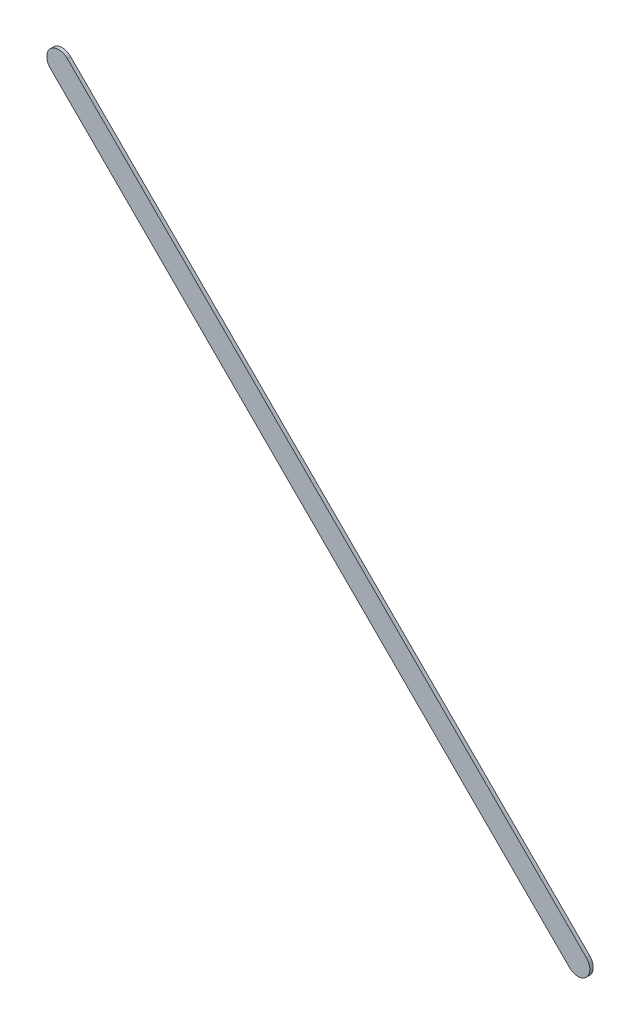
ISO-10303-21;
HEADER;
FILE_DESCRIPTION(('STEP AP214'),'2;1');
FILE_NAME('part.step','',(''),(''),'','','');
FILE_SCHEMA(('AUTOMOTIVE_DESIGN { 1 0 10303 214 1 1 1 1 }'));
ENDSEC;
DATA;
#1=APPLICATION_CONTEXT('core data for automotive mechanical design processes');
#2=APPLICATION_PROTOCOL_DEFINITION('international standard','automotive_design',2000,#1);
#3=PRODUCT_CONTEXT('',#1,'mechanical');
#4=PRODUCT('Part','Part','',(#3));
#5=PRODUCT_RELATED_PRODUCT_CATEGORY('part','',(#4));
#6=PRODUCT_DEFINITION_FORMATION('','',#4);
#7=PRODUCT_DEFINITION_CONTEXT('part definition',#1,'design');
#8=PRODUCT_DEFINITION('design','',#6,#7);
#9=PRODUCT_DEFINITION_SHAPE('','',#8);
#10=(LENGTH_UNIT() NAMED_UNIT(*) SI_UNIT(.MILLI.,.METRE.));
#11=(NAMED_UNIT(*) PLANE_ANGLE_UNIT() SI_UNIT($,.RADIAN.));
#12=(NAMED_UNIT(*) SI_UNIT($,.STERADIAN.) SOLID_ANGLE_UNIT());
#13=UNCERTAINTY_MEASURE_WITH_UNIT(LENGTH_MEASURE(1.E-05),#10,'distance_accuracy_value','');
#14=(GEOMETRIC_REPRESENTATION_CONTEXT(3) GLOBAL_UNCERTAINTY_ASSIGNED_CONTEXT((#13)) GLOBAL_UNIT_ASSIGNED_CONTEXT((#10,
#11,#12)) REPRESENTATION_CONTEXT('',''));
#15=CARTESIAN_POINT('',(0.,0.,0.));
#16=DIRECTION('',(0.,0.,1.));
#17=DIRECTION('',(1.,0.,0.));
#18=AXIS2_PLACEMENT_3D('',#15,#16,#17);
#19=CARTESIAN_POINT('',(79.4271716,82.0971688,0.));
#20=DIRECTION('',(0.707106781186548,0.707106781186548,0.));
#21=DIRECTION('',(0.707106781186548,-0.707106781186548,0.));
#22=AXIS2_PLACEMENT_3D('',#19,#20,#21);
#23=PLANE('',#22);
#24=DIRECTION('',(0.707106781186548,-0.707106781186548,0.));
#25=VECTOR('',#24,1.);
#26=CARTESIAN_POINT('',(79.4271716,82.0971688,0.03556));
#27=LINE('',#26,#25);
#28=CARTESIAN_POINT('',(79.4271716,82.0971688,0.03556));
#29=VERTEX_POINT('',#28);
#30=CARTESIAN_POINT('',(84.92716822,76.59717218,0.03556));
#31=VERTEX_POINT('',#30);
#32=EDGE_CURVE('E11',#29,#31,#27,.T.);
#33=ORIENTED_EDGE('',*,*,#32,.F.);
#34=DIRECTION('',(0.,0.,1.));
#35=VECTOR('',#34,1.);
#36=CARTESIAN_POINT('',(79.4271716,82.0971688,0.));
#37=LINE('',#36,#35);
#38=CARTESIAN_POINT('',(79.4271716,82.0971688,0.));
#39=VERTEX_POINT('',#38);
#40=EDGE_CURVE('E24',#39,#29,#37,.T.);
#41=ORIENTED_EDGE('',*,*,#40,.F.);
#42=DIRECTION('',(0.707106781186548,-0.707106781186548,0.));
#43=VECTOR('',#42,1.);
#44=CARTESIAN_POINT('',(79.4271716,82.0971688,0.));
#45=LINE('',#44,#43);
#46=CARTESIAN_POINT('',(84.92716822,76.59717218,0.));
#47=VERTEX_POINT('',#46);
#48=EDGE_CURVE('E75',#39,#47,#45,.T.);
#49=ORIENTED_EDGE('',*,*,#48,.T.);
#50=DIRECTION('',(0.,0.,1.));
#51=VECTOR('',#50,1.);
#52=CARTESIAN_POINT('',(84.92716822,76.59717218,0.));
#53=LINE('',#52,#51);
#54=EDGE_CURVE('E37',#47,#31,#53,.T.);
#55=ORIENTED_EDGE('',*,*,#54,.T.);
#56=EDGE_LOOP('',(#33,#41,#49,#55));
#57=FACE_BOUND('',#56,.T.);
#58=ADVANCED_FACE('F17',(#57),#23,.F.);
#59=CARTESIAN_POINT('',(85.01697119,76.68697515,0.));
#60=DIRECTION('',(0.,0.,-1.));
#61=DIRECTION('',(-0.707106781186548,-0.707106781186548,0.));
#62=AXIS2_PLACEMENT_3D('',#59,#60,#61);
#63=CYLINDRICAL_SURFACE('',#62,0.127000578115386);
#64=CARTESIAN_POINT('',(85.01697119,76.68697515,0.03556));
#65=DIRECTION('',(0.,0.,1.));
#66=DIRECTION('',(-0.707106781186548,-0.707106781186548,0.));
#67=AXIS2_PLACEMENT_3D('',#64,#65,#66);
#68=CIRCLE('',#67,0.127000578115386);
#69=CARTESIAN_POINT('',(85.10677416,76.77677812,0.03556));
#70=VERTEX_POINT('',#69);
#71=EDGE_CURVE('E83',#31,#70,#68,.T.);
#72=ORIENTED_EDGE('',*,*,#71,.F.);
#73=ORIENTED_EDGE('',*,*,#54,.F.);
#74=CARTESIAN_POINT('',(85.01697119,76.68697515,0.));
#75=DIRECTION('',(0.,0.,1.));
#76=DIRECTION('',(-0.707106781186548,-0.707106781186548,0.));
#77=AXIS2_PLACEMENT_3D('',#74,#75,#76);
#78=CIRCLE('',#77,0.127000578115386);
#79=CARTESIAN_POINT('',(85.10677416,76.77677812,0.));
#80=VERTEX_POINT('',#79);
#81=EDGE_CURVE('E81',#47,#80,#78,.T.);
#82=ORIENTED_EDGE('',*,*,#81,.T.);
#83=DIRECTION('',(0.,0.,1.));
#84=VECTOR('',#83,1.);
#85=CARTESIAN_POINT('',(85.10677416,76.77677812,0.));
#86=LINE('',#85,#84);
#87=EDGE_CURVE('E67',#80,#70,#86,.T.);
#88=ORIENTED_EDGE('',*,*,#87,.T.);
#89=EDGE_LOOP('',(#72,#73,#82,#88));
#90=FACE_BOUND('',#89,.T.);
#91=ADVANCED_FACE('F89',(#90),#63,.T.);
#92=CARTESIAN_POINT('',(85.10677416,76.77677812,0.));
#93=DIRECTION('',(-0.707106781186547,-0.707106781186549,0.));
#94=DIRECTION('',(-0.707106781186549,0.707106781186547,0.));
#95=AXIS2_PLACEMENT_3D('',#92,#93,#94);
#96=PLANE('',#95);
#97=DIRECTION('',(-0.707106781186549,0.707106781186547,0.));
#98=VECTOR('',#97,1.);
#99=CARTESIAN_POINT('',(85.10677416,76.77677812,0.03556));
#100=LINE('',#99,#98);
#101=CARTESIAN_POINT('',(79.60677754,82.27677474,0.03556));
#102=VERTEX_POINT('',#101);
#103=EDGE_CURVE('E71',#70,#102,#100,.T.);
#104=ORIENTED_EDGE('',*,*,#103,.F.);
#105=ORIENTED_EDGE('',*,*,#87,.F.);
#106=DIRECTION('',(-0.707106781186549,0.707106781186547,0.));
#107=VECTOR('',#106,1.);
#108=CARTESIAN_POINT('',(85.10677416,76.77677812,0.));
#109=LINE('',#108,#107);
#110=CARTESIAN_POINT('',(79.60677754,82.27677474,0.));
#111=VERTEX_POINT('',#110);
#112=EDGE_CURVE('E63',#80,#111,#109,.T.);
#113=ORIENTED_EDGE('',*,*,#112,.T.);
#114=DIRECTION('',(0.,0.,1.));
#115=VECTOR('',#114,1.);
#116=CARTESIAN_POINT('',(79.60677754,82.27677474,0.));
#117=LINE('',#116,#115);
#118=EDGE_CURVE('E53',#111,#102,#117,.T.);
#119=ORIENTED_EDGE('',*,*,#118,.T.);
#120=EDGE_LOOP('',(#104,#105,#113,#119));
#121=FACE_BOUND('',#120,.T.);
#122=ADVANCED_FACE('F66',(#121),#96,.F.);
#123=CARTESIAN_POINT('',(79.51697457,82.18697177,0.));
#124=DIRECTION('',(0.,0.,-1.));
#125=DIRECTION('',(0.707106781186492,0.707106781186604,0.));
#126=AXIS2_PLACEMENT_3D('',#123,#124,#125);
#127=CYLINDRICAL_SURFACE('',#126,0.127000578115382);
#128=CARTESIAN_POINT('',(79.51697457,82.18697177,0.03556));
#129=DIRECTION('',(0.,0.,1.));
#130=DIRECTION('',(0.707106781186492,0.707106781186604,0.));
#131=AXIS2_PLACEMENT_3D('',#128,#129,#130);
#132=CIRCLE('',#131,0.127000578115382);
#133=EDGE_CURVE('E59',#102,#29,#132,.T.);
#134=ORIENTED_EDGE('',*,*,#133,.F.);
#135=ORIENTED_EDGE('',*,*,#118,.F.);
#136=CARTESIAN_POINT('',(79.51697457,82.18697177,0.));
#137=DIRECTION('',(0.,0.,1.));
#138=DIRECTION('',(0.707106781186492,0.707106781186604,0.));
#139=AXIS2_PLACEMENT_3D('',#136,#137,#138);
#140=CIRCLE('',#139,0.127000578115382);
#141=EDGE_CURVE('E57',#111,#39,#140,.T.);
#142=ORIENTED_EDGE('',*,*,#141,.T.);
#143=ORIENTED_EDGE('',*,*,#40,.T.);
#144=EDGE_LOOP('',(#134,#135,#142,#143));
#145=FACE_BOUND('',#144,.T.);
#146=ADVANCED_FACE('F55',(#145),#127,.T.);
#147=CARTESIAN_POINT('',(79.4271716,82.0971688,0.));
#148=DIRECTION('',(0.,0.,-1.));
#149=DIRECTION('',(-1.,0.,0.));
#150=AXIS2_PLACEMENT_3D('',#147,#148,#149);
#151=PLANE('',#150);
#152=ORIENTED_EDGE('',*,*,#141,.F.);
#153=ORIENTED_EDGE('',*,*,#112,.F.);
#154=ORIENTED_EDGE('',*,*,#81,.F.);
#155=ORIENTED_EDGE('',*,*,#48,.F.);
#156=EDGE_LOOP('',(#152,#153,#154,#155));
#157=FACE_BOUND('',#156,.T.);
#158=ADVANCED_FACE('F74',(#157),#151,.T.);
#159=CARTESIAN_POINT('',(79.4271716,82.0971688,0.03556));
#160=DIRECTION('',(0.,0.,-1.));
#161=DIRECTION('',(-1.,0.,0.));
#162=AXIS2_PLACEMENT_3D('',#159,#160,#161);
#163=PLANE('',#162);
#164=ORIENTED_EDGE('',*,*,#32,.T.);
#165=ORIENTED_EDGE('',*,*,#71,.T.);
#166=ORIENTED_EDGE('',*,*,#103,.T.);
#167=ORIENTED_EDGE('',*,*,#133,.T.);
#168=EDGE_LOOP('',(#164,#165,#166,#167));
#169=FACE_BOUND('',#168,.T.);
#170=ADVANCED_FACE('F91',(#169),#163,.F.);
#171=CLOSED_SHELL('',(#58,#91,#122,#146,#158,#170));
#172=MANIFOLD_SOLID_BREP('B1',#171);
#173=ADVANCED_BREP_SHAPE_REPRESENTATION('',(#18,#172),#14);
#174=SHAPE_DEFINITION_REPRESENTATION(#9,#173);
ENDSEC;
END-ISO-10303-21;
